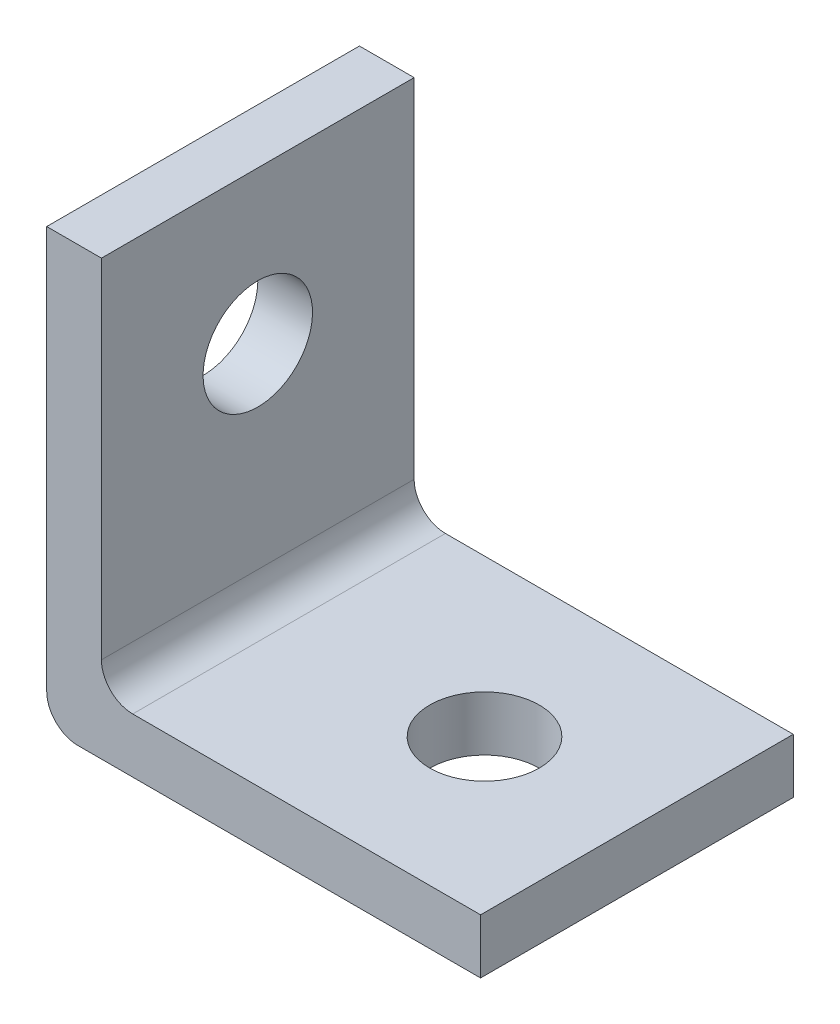
ISO-10303-21;
HEADER;
FILE_DESCRIPTION(('STEP AP214'),'2;1');
FILE_NAME('part.step','',(''),(''),'','','');
FILE_SCHEMA(('AUTOMOTIVE_DESIGN { 1 0 10303 214 1 1 1 1 }'));
ENDSEC;
DATA;
#1=APPLICATION_CONTEXT('core data for automotive mechanical design processes');
#2=APPLICATION_PROTOCOL_DEFINITION('international standard','automotive_design',2000,#1);
#3=PRODUCT_CONTEXT('',#1,'mechanical');
#4=PRODUCT('Part','Part','',(#3));
#5=PRODUCT_RELATED_PRODUCT_CATEGORY('part','',(#4));
#6=PRODUCT_DEFINITION_FORMATION('','',#4);
#7=PRODUCT_DEFINITION_CONTEXT('part definition',#1,'design');
#8=PRODUCT_DEFINITION('design','',#6,#7);
#9=PRODUCT_DEFINITION_SHAPE('','',#8);
#10=(LENGTH_UNIT() NAMED_UNIT(*) SI_UNIT(.MILLI.,.METRE.));
#11=(NAMED_UNIT(*) PLANE_ANGLE_UNIT() SI_UNIT($,.RADIAN.));
#12=(NAMED_UNIT(*) SI_UNIT($,.STERADIAN.) SOLID_ANGLE_UNIT());
#13=UNCERTAINTY_MEASURE_WITH_UNIT(LENGTH_MEASURE(1.E-05),#10,'distance_accuracy_value','');
#14=(GEOMETRIC_REPRESENTATION_CONTEXT(3) GLOBAL_UNCERTAINTY_ASSIGNED_CONTEXT((#13)) GLOBAL_UNIT_ASSIGNED_CONTEXT((#10,
#11,#12)) REPRESENTATION_CONTEXT('',''));
#15=CARTESIAN_POINT('',(0.,0.,0.));
#16=DIRECTION('',(0.,0.,1.));
#17=DIRECTION('',(1.,0.,0.));
#18=AXIS2_PLACEMENT_3D('',#15,#16,#17);
#19=CARTESIAN_POINT('',(0.,2.,20.));
#20=DIRECTION('',(1.,0.,0.));
#21=DIRECTION('',(0.,1.,0.));
#22=AXIS2_PLACEMENT_3D('',#19,#20,#21);
#23=PLANE('',#22);
#24=CARTESIAN_POINT('',(0.,18.,10.));
#25=DIRECTION('',(1.,0.,0.));
#26=DIRECTION('',(0.,1.,0.));
#27=AXIS2_PLACEMENT_3D('',#24,#25,#26);
#28=CIRCLE('',#27,3.5);
#29=CARTESIAN_POINT('',(0.,21.5,10.));
#30=VERTEX_POINT('',#29);
#31=EDGE_CURVE('E166',#30,#30,#28,.T.);
#32=ORIENTED_EDGE('',*,*,#31,.T.);
#33=EDGE_LOOP('',(#32));
#34=FACE_BOUND('',#33,.T.);
#35=DIRECTION('',(0.,-1.,0.));
#36=VECTOR('',#35,1.);
#37=CARTESIAN_POINT('',(0.,2.,20.));
#38=LINE('',#37,#36);
#39=CARTESIAN_POINT('',(0.,27.75,20.));
#40=VERTEX_POINT('',#39);
#41=CARTESIAN_POINT('',(0.,2.,20.));
#42=VERTEX_POINT('',#41);
#43=EDGE_CURVE('E111',#40,#42,#38,.T.);
#44=ORIENTED_EDGE('',*,*,#43,.F.);
#45=DIRECTION('',(0.,0.,-1.));
#46=VECTOR('',#45,1.);
#47=CARTESIAN_POINT('',(0.,27.75,20.));
#48=LINE('',#47,#46);
#49=CARTESIAN_POINT('',(0.,27.75,0.));
#50=VERTEX_POINT('',#49);
#51=EDGE_CURVE('E99',#40,#50,#48,.T.);
#52=ORIENTED_EDGE('',*,*,#51,.T.);
#53=DIRECTION('',(0.,-1.,0.));
#54=VECTOR('',#53,1.);
#55=CARTESIAN_POINT('',(0.,2.,0.));
#56=LINE('',#55,#54);
#57=CARTESIAN_POINT('',(0.,2.,0.));
#58=VERTEX_POINT('',#57);
#59=EDGE_CURVE('E137',#50,#58,#56,.T.);
#60=ORIENTED_EDGE('',*,*,#59,.T.);
#61=DIRECTION('',(0.,0.,-1.));
#62=VECTOR('',#61,1.);
#63=CARTESIAN_POINT('',(0.,2.,20.));
#64=LINE('',#63,#62);
#65=EDGE_CURVE('E11',#42,#58,#64,.T.);
#66=ORIENTED_EDGE('',*,*,#65,.F.);
#67=EDGE_LOOP('',(#44,#52,#60,#66));
#68=FACE_BOUND('',#67,.T.);
#69=ADVANCED_FACE('F37',(#34,#68),#23,.F.);
#70=CARTESIAN_POINT('',(2.,2.,20.));
#71=DIRECTION('',(0.,0.,-1.));
#72=DIRECTION('',(-1.,0.,0.));
#73=AXIS2_PLACEMENT_3D('',#70,#71,#72);
#74=CYLINDRICAL_SURFACE('',#73,2.);
#75=CARTESIAN_POINT('',(2.,2.,0.));
#76=DIRECTION('',(0.,0.,1.));
#77=DIRECTION('',(1.,0.,0.));
#78=AXIS2_PLACEMENT_3D('',#75,#76,#77);
#79=CIRCLE('',#78,2.);
#80=CARTESIAN_POINT('',(2.,0.,0.));
#81=VERTEX_POINT('',#80);
#82=EDGE_CURVE('E139',#58,#81,#79,.T.);
#83=ORIENTED_EDGE('',*,*,#82,.T.);
#84=DIRECTION('',(0.,0.,-1.));
#85=VECTOR('',#84,1.);
#86=CARTESIAN_POINT('',(2.,0.,20.));
#87=LINE('',#86,#85);
#88=CARTESIAN_POINT('',(2.,0.,20.));
#89=VERTEX_POINT('',#88);
#90=EDGE_CURVE('E44',#89,#81,#87,.T.);
#91=ORIENTED_EDGE('',*,*,#90,.F.);
#92=CARTESIAN_POINT('',(2.,2.,20.));
#93=DIRECTION('',(0.,0.,1.));
#94=DIRECTION('',(1.,0.,0.));
#95=AXIS2_PLACEMENT_3D('',#92,#93,#94);
#96=CIRCLE('',#95,2.);
#97=EDGE_CURVE('E117',#42,#89,#96,.T.);
#98=ORIENTED_EDGE('',*,*,#97,.F.);
#99=ORIENTED_EDGE('',*,*,#65,.T.);
#100=EDGE_LOOP('',(#83,#91,#98,#99));
#101=FACE_BOUND('',#100,.T.);
#102=ADVANCED_FACE('F200',(#101),#74,.T.);
#103=CARTESIAN_POINT('',(50.,0.,20.));
#104=DIRECTION('',(0.,1.,0.));
#105=DIRECTION('',(-1.,0.,0.));
#106=AXIS2_PLACEMENT_3D('',#103,#104,#105);
#107=PLANE('',#106);
#108=CARTESIAN_POINT('',(18.,0.,10.));
#109=DIRECTION('',(0.,1.,0.));
#110=DIRECTION('',(0.,0.,1.));
#111=AXIS2_PLACEMENT_3D('',#108,#109,#110);
#112=CIRCLE('',#111,3.5);
#113=CARTESIAN_POINT('',(18.,0.,13.5));
#114=VERTEX_POINT('',#113);
#115=EDGE_CURVE('E126',#114,#114,#112,.T.);
#116=ORIENTED_EDGE('',*,*,#115,.T.);
#117=EDGE_LOOP('',(#116));
#118=FACE_BOUND('',#117,.T.);
#119=DIRECTION('',(1.,0.,0.));
#120=VECTOR('',#119,1.);
#121=CARTESIAN_POINT('',(50.,0.,0.));
#122=LINE('',#121,#120);
#123=CARTESIAN_POINT('',(27.75,0.,0.));
#124=VERTEX_POINT('',#123);
#125=EDGE_CURVE('E142',#81,#124,#122,.T.);
#126=ORIENTED_EDGE('',*,*,#125,.T.);
#127=DIRECTION('',(0.,0.,1.));
#128=VECTOR('',#127,1.);
#129=CARTESIAN_POINT('',(27.75,0.,0.));
#130=LINE('',#129,#128);
#131=CARTESIAN_POINT('',(27.75,0.,20.));
#132=VERTEX_POINT('',#131);
#133=EDGE_CURVE('E59',#124,#132,#130,.T.);
#134=ORIENTED_EDGE('',*,*,#133,.T.);
#135=DIRECTION('',(1.,0.,0.));
#136=VECTOR('',#135,1.);
#137=CARTESIAN_POINT('',(50.,0.,20.));
#138=LINE('',#137,#136);
#139=EDGE_CURVE('E120',#89,#132,#138,.T.);
#140=ORIENTED_EDGE('',*,*,#139,.F.);
#141=ORIENTED_EDGE('',*,*,#90,.T.);
#142=EDGE_LOOP('',(#126,#134,#140,#141));
#143=FACE_BOUND('',#142,.T.);
#144=ADVANCED_FACE('F157',(#118,#143),#107,.F.);
#145=CARTESIAN_POINT('',(5.5,3.5,20.));
#146=DIRECTION('',(0.,-1.,0.));
#147=DIRECTION('',(1.,0.,0.));
#148=AXIS2_PLACEMENT_3D('',#145,#146,#147);
#149=PLANE('',#148);
#150=CARTESIAN_POINT('',(18.,3.5,10.));
#151=DIRECTION('',(0.,1.,0.));
#152=DIRECTION('',(0.,0.,1.));
#153=AXIS2_PLACEMENT_3D('',#150,#151,#152);
#154=CIRCLE('',#153,3.5);
#155=CARTESIAN_POINT('',(18.,3.5,13.5));
#156=VERTEX_POINT('',#155);
#157=EDGE_CURVE('E140',#156,#156,#154,.T.);
#158=ORIENTED_EDGE('',*,*,#157,.F.);
#159=EDGE_LOOP('',(#158));
#160=FACE_BOUND('',#159,.T.);
#161=DIRECTION('',(-1.,0.,0.));
#162=VECTOR('',#161,1.);
#163=CARTESIAN_POINT('',(5.5,3.5,20.));
#164=LINE('',#163,#162);
#165=CARTESIAN_POINT('',(27.75,3.5,20.));
#166=VERTEX_POINT('',#165);
#167=CARTESIAN_POINT('',(5.5,3.5,20.));
#168=VERTEX_POINT('',#167);
#169=EDGE_CURVE('E131',#166,#168,#164,.T.);
#170=ORIENTED_EDGE('',*,*,#169,.F.);
#171=DIRECTION('',(0.,0.,1.));
#172=VECTOR('',#171,1.);
#173=CARTESIAN_POINT('',(27.75,3.5,0.));
#174=LINE('',#173,#172);
#175=CARTESIAN_POINT('',(27.75,3.5,0.));
#176=VERTEX_POINT('',#175);
#177=EDGE_CURVE('E175',#176,#166,#174,.T.);
#178=ORIENTED_EDGE('',*,*,#177,.F.);
#179=DIRECTION('',(-1.,0.,0.));
#180=VECTOR('',#179,1.);
#181=CARTESIAN_POINT('',(5.5,3.5,0.));
#182=LINE('',#181,#180);
#183=CARTESIAN_POINT('',(5.5,3.5,0.));
#184=VERTEX_POINT('',#183);
#185=EDGE_CURVE('E145',#176,#184,#182,.T.);
#186=ORIENTED_EDGE('',*,*,#185,.T.);
#187=DIRECTION('',(0.,0.,-1.));
#188=VECTOR('',#187,1.);
#189=CARTESIAN_POINT('',(5.5,3.5,20.));
#190=LINE('',#189,#188);
#191=EDGE_CURVE('E150',#168,#184,#190,.T.);
#192=ORIENTED_EDGE('',*,*,#191,.F.);
#193=EDGE_LOOP('',(#170,#178,#186,#192));
#194=FACE_BOUND('',#193,.T.);
#195=ADVANCED_FACE('F221',(#160,#194),#149,.F.);
#196=CARTESIAN_POINT('',(5.5,5.5,20.));
#197=DIRECTION('',(0.,0.,-1.));
#198=DIRECTION('',(-1.,0.,0.));
#199=AXIS2_PLACEMENT_3D('',#196,#197,#198);
#200=CYLINDRICAL_SURFACE('',#199,2.);
#201=CARTESIAN_POINT('',(5.5,5.5,0.));
#202=DIRECTION('',(0.,0.,-1.));
#203=DIRECTION('',(1.,0.,0.));
#204=AXIS2_PLACEMENT_3D('',#201,#202,#203);
#205=CIRCLE('',#204,2.);
#206=CARTESIAN_POINT('',(3.5,5.5,0.));
#207=VERTEX_POINT('',#206);
#208=EDGE_CURVE('E123',#184,#207,#205,.T.);
#209=ORIENTED_EDGE('',*,*,#208,.T.);
#210=DIRECTION('',(0.,0.,-1.));
#211=VECTOR('',#210,1.);
#212=CARTESIAN_POINT('',(3.5,5.5,20.));
#213=LINE('',#212,#211);
#214=CARTESIAN_POINT('',(3.5,5.5,20.));
#215=VERTEX_POINT('',#214);
#216=EDGE_CURVE('E136',#215,#207,#213,.T.);
#217=ORIENTED_EDGE('',*,*,#216,.F.);
#218=CARTESIAN_POINT('',(5.5,5.5,20.));
#219=DIRECTION('',(0.,0.,-1.));
#220=DIRECTION('',(1.,0.,0.));
#221=AXIS2_PLACEMENT_3D('',#218,#219,#220);
#222=CIRCLE('',#221,2.);
#223=EDGE_CURVE('E133',#168,#215,#222,.T.);
#224=ORIENTED_EDGE('',*,*,#223,.F.);
#225=ORIENTED_EDGE('',*,*,#191,.T.);
#226=EDGE_LOOP('',(#209,#217,#224,#225));
#227=FACE_BOUND('',#226,.T.);
#228=ADVANCED_FACE('F212',(#227),#200,.F.);
#229=CARTESIAN_POINT('',(3.5,50.,20.));
#230=DIRECTION('',(-1.,0.,0.));
#231=DIRECTION('',(0.,-1.,0.));
#232=AXIS2_PLACEMENT_3D('',#229,#230,#231);
#233=PLANE('',#232);
#234=CARTESIAN_POINT('',(3.5,18.,10.));
#235=DIRECTION('',(1.,0.,0.));
#236=DIRECTION('',(0.,1.,0.));
#237=AXIS2_PLACEMENT_3D('',#234,#235,#236);
#238=CIRCLE('',#237,3.5);
#239=CARTESIAN_POINT('',(3.5,21.5,10.));
#240=VERTEX_POINT('',#239);
#241=EDGE_CURVE('E170',#240,#240,#238,.T.);
#242=ORIENTED_EDGE('',*,*,#241,.F.);
#243=EDGE_LOOP('',(#242));
#244=FACE_BOUND('',#243,.T.);
#245=DIRECTION('',(0.,1.,0.));
#246=VECTOR('',#245,1.);
#247=CARTESIAN_POINT('',(3.5,50.,0.));
#248=LINE('',#247,#246);
#249=CARTESIAN_POINT('',(3.5,27.75,0.));
#250=VERTEX_POINT('',#249);
#251=EDGE_CURVE('E118',#207,#250,#248,.T.);
#252=ORIENTED_EDGE('',*,*,#251,.T.);
#253=DIRECTION('',(0.,0.,-1.));
#254=VECTOR('',#253,1.);
#255=CARTESIAN_POINT('',(3.5,27.75,20.));
#256=LINE('',#255,#254);
#257=CARTESIAN_POINT('',(3.5,27.75,20.));
#258=VERTEX_POINT('',#257);
#259=EDGE_CURVE('E51',#258,#250,#256,.T.);
#260=ORIENTED_EDGE('',*,*,#259,.F.);
#261=DIRECTION('',(0.,1.,0.));
#262=VECTOR('',#261,1.);
#263=CARTESIAN_POINT('',(3.5,50.,20.));
#264=LINE('',#263,#262);
#265=EDGE_CURVE('E114',#215,#258,#264,.T.);
#266=ORIENTED_EDGE('',*,*,#265,.F.);
#267=ORIENTED_EDGE('',*,*,#216,.T.);
#268=EDGE_LOOP('',(#252,#260,#266,#267));
#269=FACE_BOUND('',#268,.T.);
#270=ADVANCED_FACE('F209',(#244,#269),#233,.F.);
#271=CARTESIAN_POINT('',(5.5,5.5,20.));
#272=DIRECTION('',(0.,0.,1.));
#273=DIRECTION('',(1.,0.,0.));
#274=AXIS2_PLACEMENT_3D('',#271,#272,#273);
#275=PLANE('',#274);
#276=DIRECTION('',(1.,0.,0.));
#277=VECTOR('',#276,1.);
#278=CARTESIAN_POINT('',(0.,27.75,20.));
#279=LINE('',#278,#277);
#280=EDGE_CURVE('E102',#40,#258,#279,.T.);
#281=ORIENTED_EDGE('',*,*,#280,.F.);
#282=ORIENTED_EDGE('',*,*,#43,.T.);
#283=ORIENTED_EDGE('',*,*,#97,.T.);
#284=ORIENTED_EDGE('',*,*,#139,.T.);
#285=DIRECTION('',(0.,1.,0.));
#286=VECTOR('',#285,1.);
#287=CARTESIAN_POINT('',(27.75,0.,20.));
#288=LINE('',#287,#286);
#289=EDGE_CURVE('E167',#132,#166,#288,.T.);
#290=ORIENTED_EDGE('',*,*,#289,.T.);
#291=ORIENTED_EDGE('',*,*,#169,.T.);
#292=ORIENTED_EDGE('',*,*,#223,.T.);
#293=ORIENTED_EDGE('',*,*,#265,.T.);
#294=EDGE_LOOP('',(#281,#282,#283,#284,#290,#291,#292,#293));
#295=FACE_BOUND('',#294,.T.);
#296=ADVANCED_FACE('F110',(#295),#275,.T.);
#297=CARTESIAN_POINT('',(5.5,5.5,0.));
#298=DIRECTION('',(0.,0.,1.));
#299=DIRECTION('',(1.,0.,0.));
#300=AXIS2_PLACEMENT_3D('',#297,#298,#299);
#301=PLANE('',#300);
#302=ORIENTED_EDGE('',*,*,#59,.F.);
#303=DIRECTION('',(1.,0.,0.));
#304=VECTOR('',#303,1.);
#305=CARTESIAN_POINT('',(0.,27.75,0.));
#306=LINE('',#305,#304);
#307=EDGE_CURVE('E103',#50,#250,#306,.T.);
#308=ORIENTED_EDGE('',*,*,#307,.T.);
#309=ORIENTED_EDGE('',*,*,#251,.F.);
#310=ORIENTED_EDGE('',*,*,#208,.F.);
#311=ORIENTED_EDGE('',*,*,#185,.F.);
#312=DIRECTION('',(0.,1.,0.));
#313=VECTOR('',#312,1.);
#314=CARTESIAN_POINT('',(27.75,0.,0.));
#315=LINE('',#314,#313);
#316=EDGE_CURVE('E163',#124,#176,#315,.T.);
#317=ORIENTED_EDGE('',*,*,#316,.F.);
#318=ORIENTED_EDGE('',*,*,#125,.F.);
#319=ORIENTED_EDGE('',*,*,#82,.F.);
#320=EDGE_LOOP('',(#302,#308,#309,#310,#311,#317,#318,#319));
#321=FACE_BOUND('',#320,.T.);
#322=ADVANCED_FACE('F161',(#321),#301,.F.);
#323=CARTESIAN_POINT('',(18.,0.,10.));
#324=DIRECTION('',(0.,1.,0.));
#325=DIRECTION('',(0.,0.,1.));
#326=AXIS2_PLACEMENT_3D('',#323,#324,#325);
#327=CYLINDRICAL_SURFACE('',#326,3.5);
#328=ORIENTED_EDGE('',*,*,#115,.F.);
#329=EDGE_LOOP('',(#328));
#330=FACE_BOUND('',#329,.T.);
#331=ORIENTED_EDGE('',*,*,#157,.T.);
#332=EDGE_LOOP('',(#331));
#333=FACE_BOUND('',#332,.T.);
#334=ADVANCED_FACE('F186',(#330,#333),#327,.F.);
#335=CARTESIAN_POINT('',(0.,18.,10.));
#336=DIRECTION('',(1.,0.,0.));
#337=DIRECTION('',(0.,1.,0.));
#338=AXIS2_PLACEMENT_3D('',#335,#336,#337);
#339=CYLINDRICAL_SURFACE('',#338,3.5);
#340=ORIENTED_EDGE('',*,*,#31,.F.);
#341=EDGE_LOOP('',(#340));
#342=FACE_BOUND('',#341,.T.);
#343=ORIENTED_EDGE('',*,*,#241,.T.);
#344=EDGE_LOOP('',(#343));
#345=FACE_BOUND('',#344,.T.);
#346=ADVANCED_FACE('F188',(#342,#345),#339,.F.);
#347=CARTESIAN_POINT('',(27.75,0.,0.));
#348=DIRECTION('',(-1.,0.,0.));
#349=DIRECTION('',(0.,-1.,0.));
#350=AXIS2_PLACEMENT_3D('',#347,#348,#349);
#351=PLANE('',#350);
#352=ORIENTED_EDGE('',*,*,#177,.T.);
#353=ORIENTED_EDGE('',*,*,#289,.F.);
#354=ORIENTED_EDGE('',*,*,#133,.F.);
#355=ORIENTED_EDGE('',*,*,#316,.T.);
#356=EDGE_LOOP('',(#352,#353,#354,#355));
#357=FACE_BOUND('',#356,.T.);
#358=ADVANCED_FACE('F194',(#357),#351,.F.);
#359=CARTESIAN_POINT('',(0.,27.75,20.));
#360=DIRECTION('',(0.,-1.,0.));
#361=DIRECTION('',(1.,0.,0.));
#362=AXIS2_PLACEMENT_3D('',#359,#360,#361);
#363=PLANE('',#362);
#364=ORIENTED_EDGE('',*,*,#259,.T.);
#365=ORIENTED_EDGE('',*,*,#307,.F.);
#366=ORIENTED_EDGE('',*,*,#51,.F.);
#367=ORIENTED_EDGE('',*,*,#280,.T.);
#368=EDGE_LOOP('',(#364,#365,#366,#367));
#369=FACE_BOUND('',#368,.T.);
#370=ADVANCED_FACE('F101',(#369),#363,.F.);
#371=CLOSED_SHELL('',(#69,#102,#144,#195,#228,#270,#296,#322,#334,#346,#358,#370));
#372=MANIFOLD_SOLID_BREP('B2',#371);
#373=ADVANCED_BREP_SHAPE_REPRESENTATION('',(#18,#372),#14);
#374=SHAPE_DEFINITION_REPRESENTATION(#9,#373);
ENDSEC;
END-ISO-10303-21;
